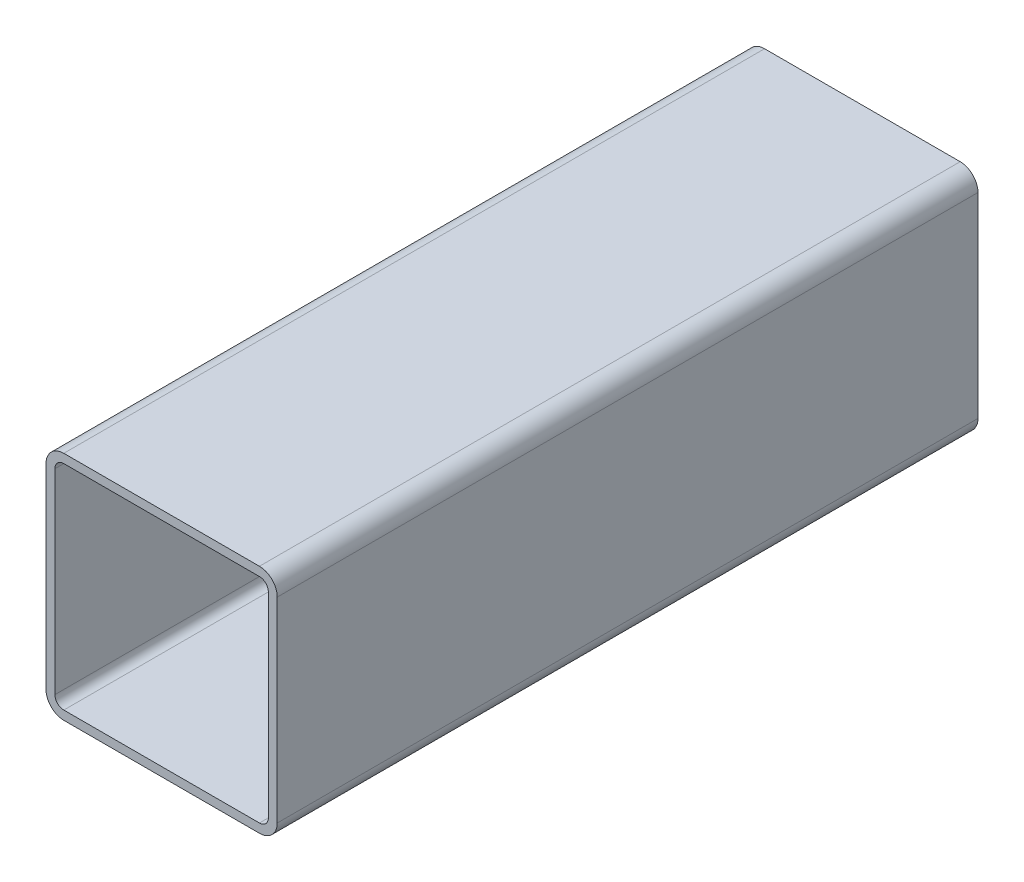
ISO-10303-21;
HEADER;
FILE_DESCRIPTION(('STEP AP214'),'2;1');
FILE_NAME('part.step','',(''),(''),'','','');
FILE_SCHEMA(('AUTOMOTIVE_DESIGN { 1 0 10303 214 1 1 1 1 }'));
ENDSEC;
DATA;
#1=APPLICATION_CONTEXT('core data for automotive mechanical design processes');
#2=APPLICATION_PROTOCOL_DEFINITION('international standard','automotive_design',2000,#1);
#3=PRODUCT_CONTEXT('',#1,'mechanical');
#4=PRODUCT('Part','Part','',(#3));
#5=PRODUCT_RELATED_PRODUCT_CATEGORY('part','',(#4));
#6=PRODUCT_DEFINITION_FORMATION('','',#4);
#7=PRODUCT_DEFINITION_CONTEXT('part definition',#1,'design');
#8=PRODUCT_DEFINITION('design','',#6,#7);
#9=PRODUCT_DEFINITION_SHAPE('','',#8);
#10=(LENGTH_UNIT() NAMED_UNIT(*) SI_UNIT(.MILLI.,.METRE.));
#11=(NAMED_UNIT(*) PLANE_ANGLE_UNIT() SI_UNIT($,.RADIAN.));
#12=(NAMED_UNIT(*) SI_UNIT($,.STERADIAN.) SOLID_ANGLE_UNIT());
#13=UNCERTAINTY_MEASURE_WITH_UNIT(LENGTH_MEASURE(1.E-05),#10,'distance_accuracy_value','');
#14=(GEOMETRIC_REPRESENTATION_CONTEXT(3) GLOBAL_UNCERTAINTY_ASSIGNED_CONTEXT((#13)) GLOBAL_UNIT_ASSIGNED_CONTEXT((#10,
#11,#12)) REPRESENTATION_CONTEXT('',''));
#15=CARTESIAN_POINT('',(0.,0.,0.));
#16=DIRECTION('',(0.,0.,1.));
#17=DIRECTION('',(1.,0.,0.));
#18=AXIS2_PLACEMENT_3D('',#15,#16,#17);
#19=CARTESIAN_POINT('',(-2.792,2.792,10.));
#20=DIRECTION('',(0.,0.,1.));
#21=DIRECTION('',(1.,0.,0.));
#22=AXIS2_PLACEMENT_3D('',#19,#20,#21);
#23=PLANE('',#22);
#24=CARTESIAN_POINT('',(-2.792,2.792,10.));
#25=DIRECTION('',(0.,0.,1.));
#26=DIRECTION('',(-1.,0.,0.));
#27=AXIS2_PLACEMENT_3D('',#24,#25,#26);
#28=CIRCLE('',#27,0.508);
#29=CARTESIAN_POINT('',(-2.792,3.3,10.));
#30=VERTEX_POINT('',#29);
#31=CARTESIAN_POINT('',(-3.3,2.792,10.));
#32=VERTEX_POINT('',#31);
#33=EDGE_CURVE('E258',#30,#32,#28,.T.);
#34=ORIENTED_EDGE('',*,*,#33,.T.);
#35=DIRECTION('',(0.,-1.,0.));
#36=VECTOR('',#35,1.);
#37=CARTESIAN_POINT('',(-3.3,-2.792,10.));
#38=LINE('',#37,#36);
#39=CARTESIAN_POINT('',(-3.3,-2.792,10.));
#40=VERTEX_POINT('',#39);
#41=EDGE_CURVE('E261',#32,#40,#38,.T.);
#42=ORIENTED_EDGE('',*,*,#41,.T.);
#43=CARTESIAN_POINT('',(-2.792,-2.792,10.));
#44=DIRECTION('',(0.,0.,1.));
#45=DIRECTION('',(-1.,0.,0.));
#46=AXIS2_PLACEMENT_3D('',#43,#44,#45);
#47=CIRCLE('',#46,0.508);
#48=CARTESIAN_POINT('',(-2.792,-3.3,10.));
#49=VERTEX_POINT('',#48);
#50=EDGE_CURVE('E264',#40,#49,#47,.T.);
#51=ORIENTED_EDGE('',*,*,#50,.T.);
#52=DIRECTION('',(1.,0.,0.));
#53=VECTOR('',#52,1.);
#54=CARTESIAN_POINT('',(-2.792,-3.3,10.));
#55=LINE('',#54,#53);
#56=CARTESIAN_POINT('',(2.792,-3.3,10.));
#57=VERTEX_POINT('',#56);
#58=EDGE_CURVE('E266',#49,#57,#55,.T.);
#59=ORIENTED_EDGE('',*,*,#58,.T.);
#60=CARTESIAN_POINT('',(2.792,-2.792,10.));
#61=DIRECTION('',(0.,0.,1.));
#62=DIRECTION('',(1.,0.,0.));
#63=AXIS2_PLACEMENT_3D('',#60,#61,#62);
#64=CIRCLE('',#63,0.508);
#65=CARTESIAN_POINT('',(3.3,-2.792,10.));
#66=VERTEX_POINT('',#65);
#67=EDGE_CURVE('E268',#57,#66,#64,.T.);
#68=ORIENTED_EDGE('',*,*,#67,.T.);
#69=DIRECTION('',(0.,1.,0.));
#70=VECTOR('',#69,1.);
#71=CARTESIAN_POINT('',(3.3,-2.792,10.));
#72=LINE('',#71,#70);
#73=CARTESIAN_POINT('',(3.3,2.792,10.));
#74=VERTEX_POINT('',#73);
#75=EDGE_CURVE('E270',#66,#74,#72,.T.);
#76=ORIENTED_EDGE('',*,*,#75,.T.);
#77=CARTESIAN_POINT('',(2.792,2.792,10.));
#78=DIRECTION('',(0.,0.,1.));
#79=DIRECTION('',(-1.,0.,0.));
#80=AXIS2_PLACEMENT_3D('',#77,#78,#79);
#81=CIRCLE('',#80,0.508);
#82=CARTESIAN_POINT('',(2.792,3.3,10.));
#83=VERTEX_POINT('',#82);
#84=EDGE_CURVE('E272',#74,#83,#81,.T.);
#85=ORIENTED_EDGE('',*,*,#84,.T.);
#86=DIRECTION('',(-1.,0.,0.));
#87=VECTOR('',#86,1.);
#88=CARTESIAN_POINT('',(-2.792,3.3,10.));
#89=LINE('',#88,#87);
#90=EDGE_CURVE('E274',#83,#30,#89,.T.);
#91=ORIENTED_EDGE('',*,*,#90,.T.);
#92=EDGE_LOOP('',(#34,#42,#51,#59,#68,#76,#85,#91));
#93=FACE_BOUND('',#92,.T.);
#94=DIRECTION('',(0.,-1.,0.));
#95=VECTOR('',#94,1.);
#96=CARTESIAN_POINT('',(-3.046,2.792,10.));
#97=LINE('',#96,#95);
#98=CARTESIAN_POINT('',(-3.046,2.792,10.));
#99=VERTEX_POINT('',#98);
#100=CARTESIAN_POINT('',(-3.046,-2.792,10.));
#101=VERTEX_POINT('',#100);
#102=EDGE_CURVE('E201',#99,#101,#97,.T.);
#103=ORIENTED_EDGE('',*,*,#102,.F.);
#104=CARTESIAN_POINT('',(-2.792,2.792,10.));
#105=DIRECTION('',(0.,0.,-1.));
#106=DIRECTION('',(-1.,0.,0.));
#107=AXIS2_PLACEMENT_3D('',#104,#105,#106);
#108=CIRCLE('',#107,0.254);
#109=CARTESIAN_POINT('',(-2.792,3.046,10.));
#110=VERTEX_POINT('',#109);
#111=EDGE_CURVE('E193',#110,#99,#108,.F.);
#112=ORIENTED_EDGE('',*,*,#111,.F.);
#113=DIRECTION('',(-1.,0.,0.));
#114=VECTOR('',#113,1.);
#115=CARTESIAN_POINT('',(-2.792,3.046,10.));
#116=LINE('',#115,#114);
#117=CARTESIAN_POINT('',(2.792,3.046,10.));
#118=VERTEX_POINT('',#117);
#119=EDGE_CURVE('E226',#118,#110,#116,.T.);
#120=ORIENTED_EDGE('',*,*,#119,.F.);
#121=CARTESIAN_POINT('',(2.792,2.792,10.));
#122=DIRECTION('',(0.,0.,-1.));
#123=DIRECTION('',(-1.,0.,0.));
#124=AXIS2_PLACEMENT_3D('',#121,#122,#123);
#125=CIRCLE('',#124,0.254);
#126=CARTESIAN_POINT('',(3.046,2.792,10.));
#127=VERTEX_POINT('',#126);
#128=EDGE_CURVE('E224',#127,#118,#125,.F.);
#129=ORIENTED_EDGE('',*,*,#128,.F.);
#130=DIRECTION('',(0.,1.,0.));
#131=VECTOR('',#130,1.);
#132=CARTESIAN_POINT('',(3.046,2.792,10.));
#133=LINE('',#132,#131);
#134=CARTESIAN_POINT('',(3.046,-2.792,10.));
#135=VERTEX_POINT('',#134);
#136=EDGE_CURVE('E222',#135,#127,#133,.T.);
#137=ORIENTED_EDGE('',*,*,#136,.F.);
#138=CARTESIAN_POINT('',(2.792,-2.792,10.));
#139=DIRECTION('',(0.,0.,-1.));
#140=DIRECTION('',(-1.,0.,0.));
#141=AXIS2_PLACEMENT_3D('',#138,#139,#140);
#142=CIRCLE('',#141,0.254);
#143=CARTESIAN_POINT('',(2.792,-3.046,10.));
#144=VERTEX_POINT('',#143);
#145=EDGE_CURVE('E220',#144,#135,#142,.F.);
#146=ORIENTED_EDGE('',*,*,#145,.F.);
#147=DIRECTION('',(1.,0.,0.));
#148=VECTOR('',#147,1.);
#149=CARTESIAN_POINT('',(-2.792,-3.046,10.));
#150=LINE('',#149,#148);
#151=CARTESIAN_POINT('',(-2.792,-3.046,10.));
#152=VERTEX_POINT('',#151);
#153=EDGE_CURVE('E216',#152,#144,#150,.T.);
#154=ORIENTED_EDGE('',*,*,#153,.F.);
#155=CARTESIAN_POINT('',(-2.792,-2.792,10.));
#156=DIRECTION('',(0.,0.,-1.));
#157=DIRECTION('',(-1.,0.,0.));
#158=AXIS2_PLACEMENT_3D('',#155,#156,#157);
#159=CIRCLE('',#158,0.254);
#160=EDGE_CURVE('E214',#101,#152,#159,.F.);
#161=ORIENTED_EDGE('',*,*,#160,.F.);
#162=EDGE_LOOP('',(#103,#112,#120,#129,#137,#146,#154,#161));
#163=FACE_BOUND('',#162,.T.);
#164=ADVANCED_FACE('F80',(#93,#163),#23,.T.);
#165=CARTESIAN_POINT('',(-2.792,2.792,-10.));
#166=DIRECTION('',(0.,0.,1.));
#167=DIRECTION('',(1.,0.,0.));
#168=AXIS2_PLACEMENT_3D('',#165,#166,#167);
#169=PLANE('',#168);
#170=CARTESIAN_POINT('',(-2.792,2.792,-10.));
#171=DIRECTION('',(0.,0.,1.));
#172=DIRECTION('',(-1.,0.,0.));
#173=AXIS2_PLACEMENT_3D('',#170,#171,#172);
#174=CIRCLE('',#173,0.508);
#175=CARTESIAN_POINT('',(-2.792,3.3,-10.));
#176=VERTEX_POINT('',#175);
#177=CARTESIAN_POINT('',(-3.3,2.792,-10.));
#178=VERTEX_POINT('',#177);
#179=EDGE_CURVE('E209',#176,#178,#174,.T.);
#180=ORIENTED_EDGE('',*,*,#179,.F.);
#181=DIRECTION('',(-1.,0.,0.));
#182=VECTOR('',#181,1.);
#183=CARTESIAN_POINT('',(-2.792,3.3,-10.));
#184=LINE('',#183,#182);
#185=CARTESIAN_POINT('',(2.792,3.3,-10.));
#186=VERTEX_POINT('',#185);
#187=EDGE_CURVE('E262',#186,#176,#184,.T.);
#188=ORIENTED_EDGE('',*,*,#187,.F.);
#189=CARTESIAN_POINT('',(2.792,2.792,-10.));
#190=DIRECTION('',(0.,0.,1.));
#191=DIRECTION('',(-1.,0.,0.));
#192=AXIS2_PLACEMENT_3D('',#189,#190,#191);
#193=CIRCLE('',#192,0.508);
#194=CARTESIAN_POINT('',(3.3,2.792,-10.));
#195=VERTEX_POINT('',#194);
#196=EDGE_CURVE('E289',#195,#186,#193,.T.);
#197=ORIENTED_EDGE('',*,*,#196,.F.);
#198=DIRECTION('',(0.,1.,0.));
#199=VECTOR('',#198,1.);
#200=CARTESIAN_POINT('',(3.3,-2.792,-10.));
#201=LINE('',#200,#199);
#202=CARTESIAN_POINT('',(3.3,-2.792,-10.));
#203=VERTEX_POINT('',#202);
#204=EDGE_CURVE('E287',#203,#195,#201,.T.);
#205=ORIENTED_EDGE('',*,*,#204,.F.);
#206=CARTESIAN_POINT('',(2.792,-2.792,-10.));
#207=DIRECTION('',(0.,0.,1.));
#208=DIRECTION('',(1.,0.,0.));
#209=AXIS2_PLACEMENT_3D('',#206,#207,#208);
#210=CIRCLE('',#209,0.508);
#211=CARTESIAN_POINT('',(2.792,-3.3,-10.));
#212=VERTEX_POINT('',#211);
#213=EDGE_CURVE('E285',#212,#203,#210,.T.);
#214=ORIENTED_EDGE('',*,*,#213,.F.);
#215=DIRECTION('',(1.,0.,0.));
#216=VECTOR('',#215,1.);
#217=CARTESIAN_POINT('',(-2.792,-3.3,-10.));
#218=LINE('',#217,#216);
#219=CARTESIAN_POINT('',(-2.792,-3.3,-10.));
#220=VERTEX_POINT('',#219);
#221=EDGE_CURVE('E283',#220,#212,#218,.T.);
#222=ORIENTED_EDGE('',*,*,#221,.F.);
#223=CARTESIAN_POINT('',(-2.792,-2.792,-10.));
#224=DIRECTION('',(0.,0.,1.));
#225=DIRECTION('',(-1.,0.,0.));
#226=AXIS2_PLACEMENT_3D('',#223,#224,#225);
#227=CIRCLE('',#226,0.508);
#228=CARTESIAN_POINT('',(-3.3,-2.792,-10.));
#229=VERTEX_POINT('',#228);
#230=EDGE_CURVE('E281',#229,#220,#227,.T.);
#231=ORIENTED_EDGE('',*,*,#230,.F.);
#232=DIRECTION('',(0.,-1.,0.));
#233=VECTOR('',#232,1.);
#234=CARTESIAN_POINT('',(-3.3,-2.792,-10.));
#235=LINE('',#234,#233);
#236=EDGE_CURVE('E279',#178,#229,#235,.T.);
#237=ORIENTED_EDGE('',*,*,#236,.F.);
#238=EDGE_LOOP('',(#180,#188,#197,#205,#214,#222,#231,#237));
#239=FACE_BOUND('',#238,.T.);
#240=CARTESIAN_POINT('',(-2.792,2.792,-10.));
#241=DIRECTION('',(0.,0.,-1.));
#242=DIRECTION('',(-1.,0.,0.));
#243=AXIS2_PLACEMENT_3D('',#240,#241,#242);
#244=CIRCLE('',#243,0.254);
#245=CARTESIAN_POINT('',(-2.792,3.046,-10.));
#246=VERTEX_POINT('',#245);
#247=CARTESIAN_POINT('',(-3.046,2.792,-10.));
#248=VERTEX_POINT('',#247);
#249=EDGE_CURVE('E103',#246,#248,#244,.F.);
#250=ORIENTED_EDGE('',*,*,#249,.T.);
#251=DIRECTION('',(0.,-1.,0.));
#252=VECTOR('',#251,1.);
#253=CARTESIAN_POINT('',(-3.046,2.792,-10.));
#254=LINE('',#253,#252);
#255=CARTESIAN_POINT('',(-3.046,-2.792,-10.));
#256=VERTEX_POINT('',#255);
#257=EDGE_CURVE('E208',#248,#256,#254,.T.);
#258=ORIENTED_EDGE('',*,*,#257,.T.);
#259=CARTESIAN_POINT('',(-2.792,-2.792,-10.));
#260=DIRECTION('',(0.,0.,-1.));
#261=DIRECTION('',(-1.,0.,0.));
#262=AXIS2_PLACEMENT_3D('',#259,#260,#261);
#263=CIRCLE('',#262,0.254);
#264=CARTESIAN_POINT('',(-2.792,-3.046,-10.));
#265=VERTEX_POINT('',#264);
#266=EDGE_CURVE('E230',#256,#265,#263,.F.);
#267=ORIENTED_EDGE('',*,*,#266,.T.);
#268=DIRECTION('',(1.,0.,0.));
#269=VECTOR('',#268,1.);
#270=CARTESIAN_POINT('',(-2.792,-3.046,-10.));
#271=LINE('',#270,#269);
#272=CARTESIAN_POINT('',(2.792,-3.046,-10.));
#273=VERTEX_POINT('',#272);
#274=EDGE_CURVE('E233',#265,#273,#271,.T.);
#275=ORIENTED_EDGE('',*,*,#274,.T.);
#276=CARTESIAN_POINT('',(2.792,-2.792,-10.));
#277=DIRECTION('',(0.,0.,-1.));
#278=DIRECTION('',(-1.,0.,0.));
#279=AXIS2_PLACEMENT_3D('',#276,#277,#278);
#280=CIRCLE('',#279,0.254);
#281=CARTESIAN_POINT('',(3.046,-2.792,-10.));
#282=VERTEX_POINT('',#281);
#283=EDGE_CURVE('E236',#273,#282,#280,.F.);
#284=ORIENTED_EDGE('',*,*,#283,.T.);
#285=DIRECTION('',(0.,1.,0.));
#286=VECTOR('',#285,1.);
#287=CARTESIAN_POINT('',(3.046,2.792,-10.));
#288=LINE('',#287,#286);
#289=CARTESIAN_POINT('',(3.046,2.792,-10.));
#290=VERTEX_POINT('',#289);
#291=EDGE_CURVE('E239',#282,#290,#288,.T.);
#292=ORIENTED_EDGE('',*,*,#291,.T.);
#293=CARTESIAN_POINT('',(2.792,2.792,-10.));
#294=DIRECTION('',(0.,0.,-1.));
#295=DIRECTION('',(-1.,0.,0.));
#296=AXIS2_PLACEMENT_3D('',#293,#294,#295);
#297=CIRCLE('',#296,0.254);
#298=CARTESIAN_POINT('',(2.792,3.046,-10.));
#299=VERTEX_POINT('',#298);
#300=EDGE_CURVE('E242',#290,#299,#297,.F.);
#301=ORIENTED_EDGE('',*,*,#300,.T.);
#302=DIRECTION('',(-1.,0.,0.));
#303=VECTOR('',#302,1.);
#304=CARTESIAN_POINT('',(-2.792,3.046,-10.));
#305=LINE('',#304,#303);
#306=EDGE_CURVE('E202',#299,#246,#305,.T.);
#307=ORIENTED_EDGE('',*,*,#306,.T.);
#308=EDGE_LOOP('',(#250,#258,#267,#275,#284,#292,#301,#307));
#309=FACE_BOUND('',#308,.T.);
#310=ADVANCED_FACE('F319',(#239,#309),#169,.F.);
#311=CARTESIAN_POINT('',(-2.792,2.792,10.));
#312=DIRECTION('',(0.,0.,-1.));
#313=DIRECTION('',(-1.,0.,0.));
#314=AXIS2_PLACEMENT_3D('',#311,#312,#313);
#315=CYLINDRICAL_SURFACE('',#314,0.508);
#316=ORIENTED_EDGE('',*,*,#179,.T.);
#317=DIRECTION('',(0.,0.,-1.));
#318=VECTOR('',#317,1.);
#319=CARTESIAN_POINT('',(-3.3,2.792,10.));
#320=LINE('',#319,#318);
#321=EDGE_CURVE('E12',#32,#178,#320,.T.);
#322=ORIENTED_EDGE('',*,*,#321,.F.);
#323=ORIENTED_EDGE('',*,*,#33,.F.);
#324=DIRECTION('',(0.,0.,-1.));
#325=VECTOR('',#324,1.);
#326=CARTESIAN_POINT('',(-2.792,3.3,10.));
#327=LINE('',#326,#325);
#328=EDGE_CURVE('E276',#30,#176,#327,.T.);
#329=ORIENTED_EDGE('',*,*,#328,.T.);
#330=EDGE_LOOP('',(#316,#322,#323,#329));
#331=FACE_BOUND('',#330,.T.);
#332=ADVANCED_FACE('F82',(#331),#315,.T.);
#333=CARTESIAN_POINT('',(-3.3,-2.792,10.));
#334=DIRECTION('',(1.,0.,0.));
#335=DIRECTION('',(0.,0.,-1.));
#336=AXIS2_PLACEMENT_3D('',#333,#334,#335);
#337=PLANE('',#336);
#338=ORIENTED_EDGE('',*,*,#236,.T.);
#339=DIRECTION('',(0.,0.,-1.));
#340=VECTOR('',#339,1.);
#341=CARTESIAN_POINT('',(-3.3,-2.792,10.));
#342=LINE('',#341,#340);
#343=EDGE_CURVE('E88',#40,#229,#342,.T.);
#344=ORIENTED_EDGE('',*,*,#343,.F.);
#345=ORIENTED_EDGE('',*,*,#41,.F.);
#346=ORIENTED_EDGE('',*,*,#321,.T.);
#347=EDGE_LOOP('',(#338,#344,#345,#346));
#348=FACE_BOUND('',#347,.T.);
#349=ADVANCED_FACE('F336',(#348),#337,.F.);
#350=CARTESIAN_POINT('',(-2.792,-2.792,10.));
#351=DIRECTION('',(0.,0.,-1.));
#352=DIRECTION('',(-1.,0.,0.));
#353=AXIS2_PLACEMENT_3D('',#350,#351,#352);
#354=CYLINDRICAL_SURFACE('',#353,0.508);
#355=ORIENTED_EDGE('',*,*,#230,.T.);
#356=DIRECTION('',(0.,0.,-1.));
#357=VECTOR('',#356,1.);
#358=CARTESIAN_POINT('',(-2.792,-3.3,10.));
#359=LINE('',#358,#357);
#360=EDGE_CURVE('E306',#49,#220,#359,.T.);
#361=ORIENTED_EDGE('',*,*,#360,.F.);
#362=ORIENTED_EDGE('',*,*,#50,.F.);
#363=ORIENTED_EDGE('',*,*,#343,.T.);
#364=EDGE_LOOP('',(#355,#361,#362,#363));
#365=FACE_BOUND('',#364,.T.);
#366=ADVANCED_FACE('F313',(#365),#354,.T.);
#367=CARTESIAN_POINT('',(-2.792,-3.3,10.));
#368=DIRECTION('',(0.,1.,0.));
#369=DIRECTION('',(0.,0.,1.));
#370=AXIS2_PLACEMENT_3D('',#367,#368,#369);
#371=PLANE('',#370);
#372=ORIENTED_EDGE('',*,*,#221,.T.);
#373=DIRECTION('',(0.,0.,-1.));
#374=VECTOR('',#373,1.);
#375=CARTESIAN_POINT('',(2.792,-3.3,10.));
#376=LINE('',#375,#374);
#377=EDGE_CURVE('E303',#57,#212,#376,.T.);
#378=ORIENTED_EDGE('',*,*,#377,.F.);
#379=ORIENTED_EDGE('',*,*,#58,.F.);
#380=ORIENTED_EDGE('',*,*,#360,.T.);
#381=EDGE_LOOP('',(#372,#378,#379,#380));
#382=FACE_BOUND('',#381,.T.);
#383=ADVANCED_FACE('F325',(#382),#371,.F.);
#384=CARTESIAN_POINT('',(2.792,-2.792,10.));
#385=DIRECTION('',(0.,0.,-1.));
#386=DIRECTION('',(-1.,0.,0.));
#387=AXIS2_PLACEMENT_3D('',#384,#385,#386);
#388=CYLINDRICAL_SURFACE('',#387,0.508);
#389=ORIENTED_EDGE('',*,*,#213,.T.);
#390=DIRECTION('',(0.,0.,-1.));
#391=VECTOR('',#390,1.);
#392=CARTESIAN_POINT('',(3.3,-2.792,10.));
#393=LINE('',#392,#391);
#394=EDGE_CURVE('E300',#66,#203,#393,.T.);
#395=ORIENTED_EDGE('',*,*,#394,.F.);
#396=ORIENTED_EDGE('',*,*,#67,.F.);
#397=ORIENTED_EDGE('',*,*,#377,.T.);
#398=EDGE_LOOP('',(#389,#395,#396,#397));
#399=FACE_BOUND('',#398,.T.);
#400=ADVANCED_FACE('F329',(#399),#388,.T.);
#401=CARTESIAN_POINT('',(3.3,-2.792,10.));
#402=DIRECTION('',(-1.,0.,0.));
#403=DIRECTION('',(0.,0.,1.));
#404=AXIS2_PLACEMENT_3D('',#401,#402,#403);
#405=PLANE('',#404);
#406=ORIENTED_EDGE('',*,*,#204,.T.);
#407=DIRECTION('',(0.,0.,-1.));
#408=VECTOR('',#407,1.);
#409=CARTESIAN_POINT('',(3.3,2.792,10.));
#410=LINE('',#409,#408);
#411=EDGE_CURVE('E297',#74,#195,#410,.T.);
#412=ORIENTED_EDGE('',*,*,#411,.F.);
#413=ORIENTED_EDGE('',*,*,#75,.F.);
#414=ORIENTED_EDGE('',*,*,#394,.T.);
#415=EDGE_LOOP('',(#406,#412,#413,#414));
#416=FACE_BOUND('',#415,.T.);
#417=ADVANCED_FACE('F349',(#416),#405,.F.);
#418=CARTESIAN_POINT('',(2.792,2.792,10.));
#419=DIRECTION('',(0.,0.,-1.));
#420=DIRECTION('',(-1.,0.,0.));
#421=AXIS2_PLACEMENT_3D('',#418,#419,#420);
#422=CYLINDRICAL_SURFACE('',#421,0.508);
#423=ORIENTED_EDGE('',*,*,#196,.T.);
#424=DIRECTION('',(0.,0.,-1.));
#425=VECTOR('',#424,1.);
#426=CARTESIAN_POINT('',(2.792,3.3,10.));
#427=LINE('',#426,#425);
#428=EDGE_CURVE('E294',#83,#186,#427,.T.);
#429=ORIENTED_EDGE('',*,*,#428,.F.);
#430=ORIENTED_EDGE('',*,*,#84,.F.);
#431=ORIENTED_EDGE('',*,*,#411,.T.);
#432=EDGE_LOOP('',(#423,#429,#430,#431));
#433=FACE_BOUND('',#432,.T.);
#434=ADVANCED_FACE('F347',(#433),#422,.T.);
#435=CARTESIAN_POINT('',(-2.792,3.3,10.));
#436=DIRECTION('',(0.,-1.,0.));
#437=DIRECTION('',(0.,0.,-1.));
#438=AXIS2_PLACEMENT_3D('',#435,#436,#437);
#439=PLANE('',#438);
#440=ORIENTED_EDGE('',*,*,#187,.T.);
#441=ORIENTED_EDGE('',*,*,#328,.F.);
#442=ORIENTED_EDGE('',*,*,#90,.F.);
#443=ORIENTED_EDGE('',*,*,#428,.T.);
#444=EDGE_LOOP('',(#440,#441,#442,#443));
#445=FACE_BOUND('',#444,.T.);
#446=ADVANCED_FACE('F342',(#445),#439,.F.);
#447=CARTESIAN_POINT('',(-2.792,2.792,10.));
#448=DIRECTION('',(0.,0.,-1.));
#449=DIRECTION('',(-1.,0.,0.));
#450=AXIS2_PLACEMENT_3D('',#447,#448,#449);
#451=CYLINDRICAL_SURFACE('',#450,0.254);
#452=ORIENTED_EDGE('',*,*,#249,.F.);
#453=DIRECTION('',(0.,0.,-1.));
#454=VECTOR('',#453,1.);
#455=CARTESIAN_POINT('',(-2.792,3.046,10.));
#456=LINE('',#455,#454);
#457=EDGE_CURVE('E197',#110,#246,#456,.T.);
#458=ORIENTED_EDGE('',*,*,#457,.F.);
#459=ORIENTED_EDGE('',*,*,#111,.T.);
#460=DIRECTION('',(0.,0.,-1.));
#461=VECTOR('',#460,1.);
#462=CARTESIAN_POINT('',(-3.046,2.792,10.));
#463=LINE('',#462,#461);
#464=EDGE_CURVE('E196',#99,#248,#463,.T.);
#465=ORIENTED_EDGE('',*,*,#464,.T.);
#466=EDGE_LOOP('',(#452,#458,#459,#465));
#467=FACE_BOUND('',#466,.T.);
#468=ADVANCED_FACE('F195',(#467),#451,.F.);
#469=CARTESIAN_POINT('',(-3.046,2.792,10.));
#470=DIRECTION('',(1.,0.,0.));
#471=DIRECTION('',(0.,0.,-1.));
#472=AXIS2_PLACEMENT_3D('',#469,#470,#471);
#473=PLANE('',#472);
#474=ORIENTED_EDGE('',*,*,#257,.F.);
#475=ORIENTED_EDGE('',*,*,#464,.F.);
#476=ORIENTED_EDGE('',*,*,#102,.T.);
#477=DIRECTION('',(0.,0.,-1.));
#478=VECTOR('',#477,1.);
#479=CARTESIAN_POINT('',(-3.046,-2.792,10.));
#480=LINE('',#479,#478);
#481=EDGE_CURVE('E210',#101,#256,#480,.T.);
#482=ORIENTED_EDGE('',*,*,#481,.T.);
#483=EDGE_LOOP('',(#474,#475,#476,#482));
#484=FACE_BOUND('',#483,.T.);
#485=ADVANCED_FACE('F205',(#484),#473,.T.);
#486=CARTESIAN_POINT('',(-2.792,-2.792,10.));
#487=DIRECTION('',(0.,0.,-1.));
#488=DIRECTION('',(-1.,0.,0.));
#489=AXIS2_PLACEMENT_3D('',#486,#487,#488);
#490=CYLINDRICAL_SURFACE('',#489,0.254);
#491=ORIENTED_EDGE('',*,*,#266,.F.);
#492=ORIENTED_EDGE('',*,*,#481,.F.);
#493=ORIENTED_EDGE('',*,*,#160,.T.);
#494=DIRECTION('',(0.,0.,-1.));
#495=VECTOR('',#494,1.);
#496=CARTESIAN_POINT('',(-2.792,-3.046,10.));
#497=LINE('',#496,#495);
#498=EDGE_CURVE('E255',#152,#265,#497,.T.);
#499=ORIENTED_EDGE('',*,*,#498,.T.);
#500=EDGE_LOOP('',(#491,#492,#493,#499));
#501=FACE_BOUND('',#500,.T.);
#502=ADVANCED_FACE('F374',(#501),#490,.F.);
#503=CARTESIAN_POINT('',(-2.792,-3.046,10.));
#504=DIRECTION('',(0.,1.,0.));
#505=DIRECTION('',(0.,0.,1.));
#506=AXIS2_PLACEMENT_3D('',#503,#504,#505);
#507=PLANE('',#506);
#508=ORIENTED_EDGE('',*,*,#274,.F.);
#509=ORIENTED_EDGE('',*,*,#498,.F.);
#510=ORIENTED_EDGE('',*,*,#153,.T.);
#511=DIRECTION('',(0.,0.,-1.));
#512=VECTOR('',#511,1.);
#513=CARTESIAN_POINT('',(2.792,-3.046,10.));
#514=LINE('',#513,#512);
#515=EDGE_CURVE('E253',#144,#273,#514,.T.);
#516=ORIENTED_EDGE('',*,*,#515,.T.);
#517=EDGE_LOOP('',(#508,#509,#510,#516));
#518=FACE_BOUND('',#517,.T.);
#519=ADVANCED_FACE('F378',(#518),#507,.T.);
#520=CARTESIAN_POINT('',(2.792,-2.792,10.));
#521=DIRECTION('',(0.,0.,-1.));
#522=DIRECTION('',(-1.,0.,0.));
#523=AXIS2_PLACEMENT_3D('',#520,#521,#522);
#524=CYLINDRICAL_SURFACE('',#523,0.254);
#525=ORIENTED_EDGE('',*,*,#283,.F.);
#526=ORIENTED_EDGE('',*,*,#515,.F.);
#527=ORIENTED_EDGE('',*,*,#145,.T.);
#528=DIRECTION('',(0.,0.,-1.));
#529=VECTOR('',#528,1.);
#530=CARTESIAN_POINT('',(3.046,-2.792,10.));
#531=LINE('',#530,#529);
#532=EDGE_CURVE('E251',#135,#282,#531,.T.);
#533=ORIENTED_EDGE('',*,*,#532,.T.);
#534=EDGE_LOOP('',(#525,#526,#527,#533));
#535=FACE_BOUND('',#534,.T.);
#536=ADVANCED_FACE('F384',(#535),#524,.F.);
#537=CARTESIAN_POINT('',(3.046,2.792,10.));
#538=DIRECTION('',(-1.,0.,0.));
#539=DIRECTION('',(0.,0.,1.));
#540=AXIS2_PLACEMENT_3D('',#537,#538,#539);
#541=PLANE('',#540);
#542=ORIENTED_EDGE('',*,*,#291,.F.);
#543=ORIENTED_EDGE('',*,*,#532,.F.);
#544=ORIENTED_EDGE('',*,*,#136,.T.);
#545=DIRECTION('',(0.,0.,-1.));
#546=VECTOR('',#545,1.);
#547=CARTESIAN_POINT('',(3.046,2.792,10.));
#548=LINE('',#547,#546);
#549=EDGE_CURVE('E249',#127,#290,#548,.T.);
#550=ORIENTED_EDGE('',*,*,#549,.T.);
#551=EDGE_LOOP('',(#542,#543,#544,#550));
#552=FACE_BOUND('',#551,.T.);
#553=ADVANCED_FACE('F388',(#552),#541,.T.);
#554=CARTESIAN_POINT('',(2.792,2.792,10.));
#555=DIRECTION('',(0.,0.,-1.));
#556=DIRECTION('',(-1.,0.,0.));
#557=AXIS2_PLACEMENT_3D('',#554,#555,#556);
#558=CYLINDRICAL_SURFACE('',#557,0.254);
#559=ORIENTED_EDGE('',*,*,#300,.F.);
#560=ORIENTED_EDGE('',*,*,#549,.F.);
#561=ORIENTED_EDGE('',*,*,#128,.T.);
#562=DIRECTION('',(0.,0.,-1.));
#563=VECTOR('',#562,1.);
#564=CARTESIAN_POINT('',(2.792,3.046,10.));
#565=LINE('',#564,#563);
#566=EDGE_CURVE('E95',#118,#299,#565,.T.);
#567=ORIENTED_EDGE('',*,*,#566,.T.);
#568=EDGE_LOOP('',(#559,#560,#561,#567));
#569=FACE_BOUND('',#568,.T.);
#570=ADVANCED_FACE('F392',(#569),#558,.F.);
#571=CARTESIAN_POINT('',(-2.792,3.046,10.));
#572=DIRECTION('',(0.,-1.,0.));
#573=DIRECTION('',(0.,0.,-1.));
#574=AXIS2_PLACEMENT_3D('',#571,#572,#573);
#575=PLANE('',#574);
#576=ORIENTED_EDGE('',*,*,#306,.F.);
#577=ORIENTED_EDGE('',*,*,#566,.F.);
#578=ORIENTED_EDGE('',*,*,#119,.T.);
#579=ORIENTED_EDGE('',*,*,#457,.T.);
#580=EDGE_LOOP('',(#576,#577,#578,#579));
#581=FACE_BOUND('',#580,.T.);
#582=ADVANCED_FACE('F396',(#581),#575,.T.);
#583=CLOSED_SHELL('',(#164,#310,#332,#349,#366,#383,#400,#417,#434,#446,#468,#485,#502,#519,
#536,#553,#570,#582));
#584=MANIFOLD_SOLID_BREP('B2',#583);
#585=ADVANCED_BREP_SHAPE_REPRESENTATION('',(#18,#584),#14);
#586=SHAPE_DEFINITION_REPRESENTATION(#9,#585);
ENDSEC;
END-ISO-10303-21;
